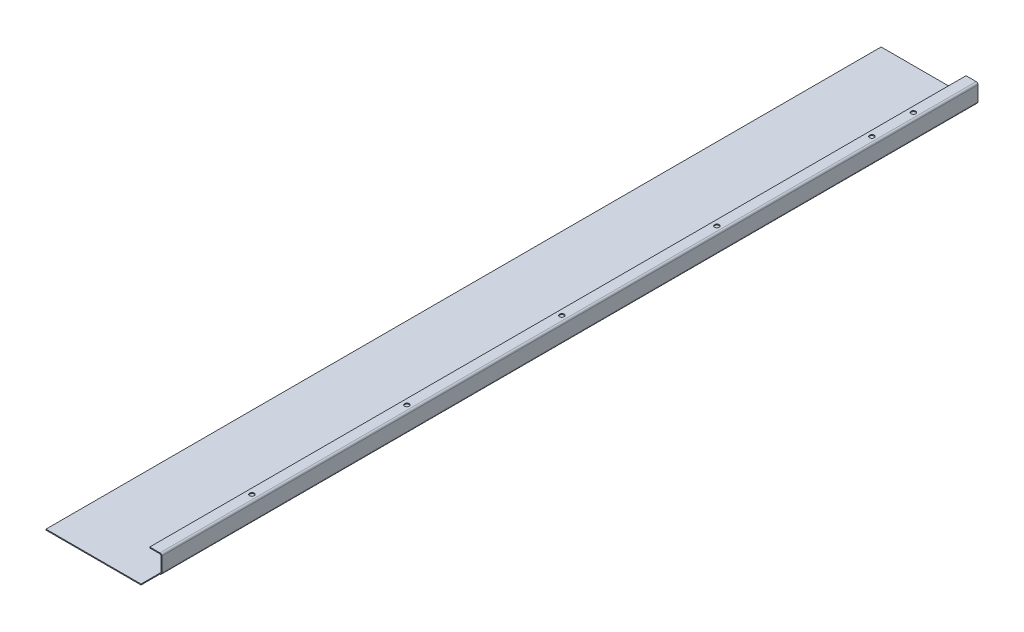
ISO-10303-21;
HEADER;
FILE_DESCRIPTION(('STEP AP214'),'2;1');
FILE_NAME('part.step','',(''),(''),'','','');
FILE_SCHEMA(('AUTOMOTIVE_DESIGN { 1 0 10303 214 1 1 1 1 }'));
ENDSEC;
DATA;
#1=APPLICATION_CONTEXT('core data for automotive mechanical design processes');
#2=APPLICATION_PROTOCOL_DEFINITION('international standard','automotive_design',2000,#1);
#3=PRODUCT_CONTEXT('',#1,'mechanical');
#4=PRODUCT('Part','Part','',(#3));
#5=PRODUCT_RELATED_PRODUCT_CATEGORY('part','',(#4));
#6=PRODUCT_DEFINITION_FORMATION('','',#4);
#7=PRODUCT_DEFINITION_CONTEXT('part definition',#1,'design');
#8=PRODUCT_DEFINITION('design','',#6,#7);
#9=PRODUCT_DEFINITION_SHAPE('','',#8);
#10=(LENGTH_UNIT() NAMED_UNIT(*) SI_UNIT(.MILLI.,.METRE.));
#11=(NAMED_UNIT(*) PLANE_ANGLE_UNIT() SI_UNIT($,.RADIAN.));
#12=(NAMED_UNIT(*) SI_UNIT($,.STERADIAN.) SOLID_ANGLE_UNIT());
#13=UNCERTAINTY_MEASURE_WITH_UNIT(LENGTH_MEASURE(1.E-05),#10,'distance_accuracy_value','');
#14=(GEOMETRIC_REPRESENTATION_CONTEXT(3) GLOBAL_UNCERTAINTY_ASSIGNED_CONTEXT((#13)) GLOBAL_UNIT_ASSIGNED_CONTEXT((#10,
#11,#12)) REPRESENTATION_CONTEXT('',''));
#15=CARTESIAN_POINT('',(0.,0.,0.));
#16=DIRECTION('',(0.,0.,1.));
#17=DIRECTION('',(1.,0.,0.));
#18=AXIS2_PLACEMENT_3D('',#15,#16,#17);
#19=CARTESIAN_POINT('',(105.,-3.86956670765295E-13,0.));
#20=DIRECTION('',(-1.,0.,0.));
#21=DIRECTION('',(0.,-1.,0.));
#22=AXIS2_PLACEMENT_3D('',#19,#20,#21);
#23=PLANE('',#22);
#24=DIRECTION('',(0.,-1.,0.));
#25=VECTOR('',#24,1.);
#26=CARTESIAN_POINT('',(105.,-3.87117238849561E-13,-20.5));
#27=LINE('',#26,#25);
#28=CARTESIAN_POINT('',(105.,17.,-20.5));
#29=VERTEX_POINT('',#28);
#30=CARTESIAN_POINT('',(105.,0.999999999999942,-20.5));
#31=VERTEX_POINT('',#30);
#32=EDGE_CURVE('E369',#29,#31,#27,.T.);
#33=ORIENTED_EDGE('',*,*,#32,.T.);
#34=DIRECTION('',(0.,0.,-1.));
#35=VECTOR('',#34,1.);
#36=CARTESIAN_POINT('',(105.,0.999999999999997,0.));
#37=LINE('',#36,#35);
#38=CARTESIAN_POINT('',(105.,0.999999999999942,-905.2));
#39=VERTEX_POINT('',#38);
#40=EDGE_CURVE('E239',#39,#31,#37,.F.);
#41=ORIENTED_EDGE('',*,*,#40,.F.);
#42=DIRECTION('',(0.,1.,0.));
#43=VECTOR('',#42,1.);
#44=CARTESIAN_POINT('',(105.,-3.86956670765295E-13,-905.2));
#45=LINE('',#44,#43);
#46=CARTESIAN_POINT('',(105.,17.,-905.2));
#47=VERTEX_POINT('',#46);
#48=EDGE_CURVE('E234',#39,#47,#45,.T.);
#49=ORIENTED_EDGE('',*,*,#48,.T.);
#50=DIRECTION('',(0.,0.,-1.));
#51=VECTOR('',#50,1.);
#52=CARTESIAN_POINT('',(105.,17.,-905.2));
#53=LINE('',#52,#51);
#54=EDGE_CURVE('E222',#47,#29,#53,.F.);
#55=ORIENTED_EDGE('',*,*,#54,.T.);
#56=EDGE_LOOP('',(#33,#41,#49,#55));
#57=FACE_BOUND('',#56,.T.);
#58=ADVANCED_FACE('F80',(#57),#23,.F.);
#59=CARTESIAN_POINT('',(104.,-3.83465189426452E-13,0.));
#60=DIRECTION('',(-1.,0.,0.));
#61=DIRECTION('',(0.,-1.,0.));
#62=AXIS2_PLACEMENT_3D('',#59,#60,#61);
#63=PLANE('',#62);
#64=DIRECTION('',(0.,0.,-1.));
#65=VECTOR('',#64,1.);
#66=CARTESIAN_POINT('',(104.,1.,0.));
#67=LINE('',#66,#65);
#68=CARTESIAN_POINT('',(104.,0.999999999999945,-20.5));
#69=VERTEX_POINT('',#68);
#70=CARTESIAN_POINT('',(104.,0.999999999999973,-905.2));
#71=VERTEX_POINT('',#70);
#72=EDGE_CURVE('E233',#69,#71,#67,.T.);
#73=ORIENTED_EDGE('',*,*,#72,.F.);
#74=DIRECTION('',(0.,-1.,0.));
#75=VECTOR('',#74,1.);
#76=CARTESIAN_POINT('',(104.,-3.83465189426452E-13,-20.5));
#77=LINE('',#76,#75);
#78=CARTESIAN_POINT('',(104.,17.,-20.5));
#79=VERTEX_POINT('',#78);
#80=EDGE_CURVE('E370',#79,#69,#77,.T.);
#81=ORIENTED_EDGE('',*,*,#80,.F.);
#82=DIRECTION('',(0.,0.,-1.));
#83=VECTOR('',#82,1.);
#84=CARTESIAN_POINT('',(104.,17.,-905.2));
#85=LINE('',#84,#83);
#86=CARTESIAN_POINT('',(104.,17.,-905.2));
#87=VERTEX_POINT('',#86);
#88=EDGE_CURVE('E105',#87,#79,#85,.F.);
#89=ORIENTED_EDGE('',*,*,#88,.F.);
#90=DIRECTION('',(0.,-1.,0.));
#91=VECTOR('',#90,1.);
#92=CARTESIAN_POINT('',(104.,19.,-905.2));
#93=LINE('',#92,#91);
#94=EDGE_CURVE('E237',#71,#87,#93,.F.);
#95=ORIENTED_EDGE('',*,*,#94,.F.);
#96=EDGE_LOOP('',(#73,#81,#89,#95));
#97=FACE_BOUND('',#96,.T.);
#98=ADVANCED_FACE('F387',(#97),#63,.T.);
#99=CARTESIAN_POINT('',(103.,0.999999999999977,-905.2));
#100=DIRECTION('',(0.,0.,-1.));
#101=DIRECTION('',(1.,0.,0.));
#102=AXIS2_PLACEMENT_3D('',#99,#100,#101);
#103=CYLINDRICAL_SURFACE('',#102,2.00000000000008);
#104=ORIENTED_EDGE('',*,*,#40,.T.);
#105=CARTESIAN_POINT('',(103.,0.999999999999893,-20.5));
#106=DIRECTION('',(0.,0.,-1.));
#107=DIRECTION('',(-1.,0.,0.));
#108=AXIS2_PLACEMENT_3D('',#105,#106,#107);
#109=CIRCLE('',#108,2.);
#110=CARTESIAN_POINT('',(103.,-1.00000000000011,-20.5));
#111=VERTEX_POINT('',#110);
#112=EDGE_CURVE('E339',#31,#111,#109,.T.);
#113=ORIENTED_EDGE('',*,*,#112,.T.);
#114=DIRECTION('',(0.,0.,-1.));
#115=VECTOR('',#114,1.);
#116=CARTESIAN_POINT('',(103.,-1.00000000000011,-905.2));
#117=LINE('',#116,#115);
#118=CARTESIAN_POINT('',(103.,-1.00000000000011,-905.2));
#119=VERTEX_POINT('',#118);
#120=EDGE_CURVE('E246',#119,#111,#117,.F.);
#121=ORIENTED_EDGE('',*,*,#120,.F.);
#122=CARTESIAN_POINT('',(103.,0.999999999999977,-905.2));
#123=DIRECTION('',(0.,0.,-1.));
#124=DIRECTION('',(-1.,0.,0.));
#125=AXIS2_PLACEMENT_3D('',#122,#123,#124);
#126=CIRCLE('',#125,2.00000000000008);
#127=EDGE_CURVE('E250',#39,#119,#126,.T.);
#128=ORIENTED_EDGE('',*,*,#127,.F.);
#129=EDGE_LOOP('',(#104,#113,#121,#128));
#130=FACE_BOUND('',#129,.T.);
#131=ADVANCED_FACE('F393',(#130),#103,.T.);
#132=CARTESIAN_POINT('',(103.,0.999999999999977,-905.2));
#133=DIRECTION('',(0.,0.,-1.));
#134=DIRECTION('',(1.,0.,0.));
#135=AXIS2_PLACEMENT_3D('',#132,#133,#134);
#136=CYLINDRICAL_SURFACE('',#135,1.00000000000008);
#137=CARTESIAN_POINT('',(103.,0.999999999999893,-20.5));
#138=DIRECTION('',(0.,0.,1.));
#139=DIRECTION('',(1.,0.,0.));
#140=AXIS2_PLACEMENT_3D('',#137,#138,#139);
#141=CIRCLE('',#140,1.);
#142=CARTESIAN_POINT('',(103.,-1.07336015076065E-13,-20.5));
#143=VERTEX_POINT('',#142);
#144=EDGE_CURVE('E355',#69,#143,#141,.F.);
#145=ORIENTED_EDGE('',*,*,#144,.F.);
#146=ORIENTED_EDGE('',*,*,#72,.T.);
#147=CARTESIAN_POINT('',(103.,0.999999999999977,-905.2));
#148=DIRECTION('',(0.,0.,-1.));
#149=DIRECTION('',(-1.,0.,0.));
#150=AXIS2_PLACEMENT_3D('',#147,#148,#149);
#151=CIRCLE('',#150,1.00000000000008);
#152=CARTESIAN_POINT('',(103.,-1.07336015076065E-13,-905.2));
#153=VERTEX_POINT('',#152);
#154=EDGE_CURVE('E236',#71,#153,#151,.T.);
#155=ORIENTED_EDGE('',*,*,#154,.T.);
#156=DIRECTION('',(0.,0.,-1.));
#157=VECTOR('',#156,1.);
#158=CARTESIAN_POINT('',(103.,-1.07336015076065E-13,-905.2));
#159=LINE('',#158,#157);
#160=EDGE_CURVE('E253',#153,#143,#159,.F.);
#161=ORIENTED_EDGE('',*,*,#160,.T.);
#162=EDGE_LOOP('',(#145,#146,#155,#161));
#163=FACE_BOUND('',#162,.T.);
#164=ADVANCED_FACE('F400',(#163),#136,.F.);
#165=CARTESIAN_POINT('',(103.,17.,-905.2));
#166=DIRECTION('',(0.,0.,-1.));
#167=DIRECTION('',(0.,1.,0.));
#168=AXIS2_PLACEMENT_3D('',#165,#166,#167);
#169=CYLINDRICAL_SURFACE('',#168,2.);
#170=DIRECTION('',(0.,0.,-1.));
#171=VECTOR('',#170,1.);
#172=CARTESIAN_POINT('',(103.,19.,0.));
#173=LINE('',#172,#171);
#174=CARTESIAN_POINT('',(103.,19.,-905.2));
#175=VERTEX_POINT('',#174);
#176=CARTESIAN_POINT('',(103.,19.,-20.5));
#177=VERTEX_POINT('',#176);
#178=EDGE_CURVE('E202',#175,#177,#173,.F.);
#179=ORIENTED_EDGE('',*,*,#178,.T.);
#180=CARTESIAN_POINT('',(103.,17.,-20.5000000000002));
#181=DIRECTION('',(0.,0.,-1.));
#182=DIRECTION('',(-1.,0.,0.));
#183=AXIS2_PLACEMENT_3D('',#180,#181,#182);
#184=CIRCLE('',#183,2.);
#185=EDGE_CURVE('E186',#177,#29,#184,.T.);
#186=ORIENTED_EDGE('',*,*,#185,.T.);
#187=ORIENTED_EDGE('',*,*,#54,.F.);
#188=CARTESIAN_POINT('',(103.,17.,-905.2));
#189=DIRECTION('',(0.,0.,-1.));
#190=DIRECTION('',(-1.,0.,0.));
#191=AXIS2_PLACEMENT_3D('',#188,#189,#190);
#192=CIRCLE('',#191,2.);
#193=EDGE_CURVE('E210',#175,#47,#192,.T.);
#194=ORIENTED_EDGE('',*,*,#193,.F.);
#195=EDGE_LOOP('',(#179,#186,#187,#194));
#196=FACE_BOUND('',#195,.T.);
#197=ADVANCED_FACE('F208',(#196),#169,.T.);
#198=CARTESIAN_POINT('',(103.,17.,-905.2));
#199=DIRECTION('',(0.,0.,-1.));
#200=DIRECTION('',(0.,1.,0.));
#201=AXIS2_PLACEMENT_3D('',#198,#199,#200);
#202=CYLINDRICAL_SURFACE('',#201,1.);
#203=CARTESIAN_POINT('',(103.,17.,-20.5000000000002));
#204=DIRECTION('',(0.,0.,1.));
#205=DIRECTION('',(1.,0.,0.));
#206=AXIS2_PLACEMENT_3D('',#203,#204,#205);
#207=CIRCLE('',#206,1.);
#208=CARTESIAN_POINT('',(103.,18.,-20.5000000000002));
#209=VERTEX_POINT('',#208);
#210=EDGE_CURVE('E196',#209,#79,#207,.F.);
#211=ORIENTED_EDGE('',*,*,#210,.F.);
#212=DIRECTION('',(0.,0.,-1.));
#213=VECTOR('',#212,1.);
#214=CARTESIAN_POINT('',(103.,18.,0.));
#215=LINE('',#214,#213);
#216=CARTESIAN_POINT('',(103.,18.,-905.2));
#217=VERTEX_POINT('',#216);
#218=EDGE_CURVE('E217',#209,#217,#215,.T.);
#219=ORIENTED_EDGE('',*,*,#218,.T.);
#220=CARTESIAN_POINT('',(103.,17.,-905.2));
#221=DIRECTION('',(0.,0.,-1.));
#222=DIRECTION('',(-1.,0.,0.));
#223=AXIS2_PLACEMENT_3D('',#220,#221,#222);
#224=CIRCLE('',#223,1.);
#225=EDGE_CURVE('E227',#217,#87,#224,.T.);
#226=ORIENTED_EDGE('',*,*,#225,.T.);
#227=ORIENTED_EDGE('',*,*,#88,.T.);
#228=EDGE_LOOP('',(#211,#219,#226,#227));
#229=FACE_BOUND('',#228,.T.);
#230=ADVANCED_FACE('F321',(#229),#202,.F.);
#231=CARTESIAN_POINT('',(1.40823756520346E-13,19.0000000000008,0.));
#232=DIRECTION('',(0.,-1.,0.));
#233=DIRECTION('',(1.,0.,0.));
#234=AXIS2_PLACEMENT_3D('',#231,#232,#233);
#235=PLANE('',#234);
#236=CARTESIAN_POINT('',(98.0000000000165,19.,-125.2));
#237=DIRECTION('',(0.,1.,0.));
#238=DIRECTION('',(-1.,0.,0.));
#239=AXIS2_PLACEMENT_3D('',#236,#237,#238);
#240=CIRCLE('',#239,2.5);
#241=CARTESIAN_POINT('',(95.5000000000165,19.0000000000001,-125.2));
#242=VERTEX_POINT('',#241);
#243=EDGE_CURVE('E335',#242,#242,#240,.T.);
#244=ORIENTED_EDGE('',*,*,#243,.F.);
#245=EDGE_LOOP('',(#244));
#246=FACE_BOUND('',#245,.T.);
#247=CARTESIAN_POINT('',(98.0000000000123,19.,-293.2));
#248=DIRECTION('',(0.,1.,0.));
#249=DIRECTION('',(-1.,0.,0.));
#250=AXIS2_PLACEMENT_3D('',#247,#248,#249);
#251=CIRCLE('',#250,2.50000000000001);
#252=CARTESIAN_POINT('',(95.5000000000123,19.0000000000001,-293.2));
#253=VERTEX_POINT('',#252);
#254=EDGE_CURVE('E338',#253,#253,#251,.T.);
#255=ORIENTED_EDGE('',*,*,#254,.F.);
#256=EDGE_LOOP('',(#255));
#257=FACE_BOUND('',#256,.T.);
#258=CARTESIAN_POINT('',(98.0000000000082,19.,-461.2));
#259=DIRECTION('',(0.,1.,0.));
#260=DIRECTION('',(-1.,0.,0.));
#261=AXIS2_PLACEMENT_3D('',#258,#259,#260);
#262=CIRCLE('',#261,2.50000000000001);
#263=CARTESIAN_POINT('',(95.5000000000082,19.0000000000001,-461.2));
#264=VERTEX_POINT('',#263);
#265=EDGE_CURVE('E342',#264,#264,#262,.T.);
#266=ORIENTED_EDGE('',*,*,#265,.F.);
#267=EDGE_LOOP('',(#266));
#268=FACE_BOUND('',#267,.T.);
#269=CARTESIAN_POINT('',(98.0000000000041,19.,-629.2));
#270=DIRECTION('',(0.,1.,0.));
#271=DIRECTION('',(-1.,0.,0.));
#272=AXIS2_PLACEMENT_3D('',#269,#270,#271);
#273=CIRCLE('',#272,2.5);
#274=CARTESIAN_POINT('',(95.5000000000041,19.0000000000001,-629.2));
#275=VERTEX_POINT('',#274);
#276=EDGE_CURVE('E345',#275,#275,#273,.T.);
#277=ORIENTED_EDGE('',*,*,#276,.F.);
#278=EDGE_LOOP('',(#277));
#279=FACE_BOUND('',#278,.T.);
#280=CARTESIAN_POINT('',(97.9999999999999,19.,-797.2));
#281=DIRECTION('',(0.,1.,0.));
#282=DIRECTION('',(-1.,0.,0.));
#283=AXIS2_PLACEMENT_3D('',#280,#281,#282);
#284=CIRCLE('',#283,2.50000000000001);
#285=CARTESIAN_POINT('',(95.4999999999999,19.0000000000001,-797.2));
#286=VERTEX_POINT('',#285);
#287=EDGE_CURVE('E348',#286,#286,#284,.T.);
#288=ORIENTED_EDGE('',*,*,#287,.F.);
#289=EDGE_LOOP('',(#288));
#290=FACE_BOUND('',#289,.T.);
#291=CARTESIAN_POINT('',(97.9999999999999,19.,-842.2));
#292=DIRECTION('',(0.,1.,0.));
#293=DIRECTION('',(-1.,0.,0.));
#294=AXIS2_PLACEMENT_3D('',#291,#292,#293);
#295=CIRCLE('',#294,2.5);
#296=CARTESIAN_POINT('',(95.4999999999999,19.0000000000001,-842.2));
#297=VERTEX_POINT('',#296);
#298=EDGE_CURVE('E283',#297,#297,#295,.T.);
#299=ORIENTED_EDGE('',*,*,#298,.F.);
#300=EDGE_LOOP('',(#299));
#301=FACE_BOUND('',#300,.T.);
#302=DIRECTION('',(1.,0.,0.));
#303=VECTOR('',#302,1.);
#304=CARTESIAN_POINT('',(1.4090824024163E-13,19.0000000000008,-20.5));
#305=LINE('',#304,#303);
#306=CARTESIAN_POINT('',(92.0000000000001,19.0000000000001,-20.5));
#307=VERTEX_POINT('',#306);
#308=EDGE_CURVE('E97',#307,#177,#305,.T.);
#309=ORIENTED_EDGE('',*,*,#308,.T.);
#310=ORIENTED_EDGE('',*,*,#178,.F.);
#311=DIRECTION('',(-1.,0.,0.));
#312=VECTOR('',#311,1.);
#313=CARTESIAN_POINT('',(1.40823756520346E-13,19.0000000000008,-905.2));
#314=LINE('',#313,#312);
#315=CARTESIAN_POINT('',(91.9999999999999,19.0000000000001,-905.2));
#316=VERTEX_POINT('',#315);
#317=EDGE_CURVE('E329',#175,#316,#314,.T.);
#318=ORIENTED_EDGE('',*,*,#317,.T.);
#319=DIRECTION('',(0.,0.,1.));
#320=VECTOR('',#319,1.);
#321=CARTESIAN_POINT('',(92.0000000000001,19.0000000000001,0.));
#322=LINE('',#321,#320);
#323=EDGE_CURVE('E205',#316,#307,#322,.T.);
#324=ORIENTED_EDGE('',*,*,#323,.T.);
#325=EDGE_LOOP('',(#309,#310,#318,#324));
#326=FACE_BOUND('',#325,.T.);
#327=ADVANCED_FACE('F201',(#246,#257,#268,#279,#290,#301,#326),#235,.F.);
#328=CARTESIAN_POINT('',(1.33680225758394E-13,18.0000000000008,0.));
#329=DIRECTION('',(0.,-1.,0.));
#330=DIRECTION('',(1.,0.,0.));
#331=AXIS2_PLACEMENT_3D('',#328,#329,#330);
#332=PLANE('',#331);
#333=CARTESIAN_POINT('',(97.9999999999999,18.,-842.2));
#334=DIRECTION('',(0.,-1.,0.));
#335=DIRECTION('',(1.,0.,0.));
#336=AXIS2_PLACEMENT_3D('',#333,#334,#335);
#337=CIRCLE('',#336,2.5);
#338=CARTESIAN_POINT('',(100.5,18.,-842.2));
#339=VERTEX_POINT('',#338);
#340=EDGE_CURVE('E84',#339,#339,#337,.T.);
#341=ORIENTED_EDGE('',*,*,#340,.F.);
#342=EDGE_LOOP('',(#341));
#343=FACE_BOUND('',#342,.T.);
#344=CARTESIAN_POINT('',(97.9999999999999,18.,-797.2));
#345=DIRECTION('',(0.,-1.,0.));
#346=DIRECTION('',(1.,0.,0.));
#347=AXIS2_PLACEMENT_3D('',#344,#345,#346);
#348=CIRCLE('',#347,2.50000000000001);
#349=CARTESIAN_POINT('',(100.5,18.,-797.2));
#350=VERTEX_POINT('',#349);
#351=EDGE_CURVE('E291',#350,#350,#348,.T.);
#352=ORIENTED_EDGE('',*,*,#351,.F.);
#353=EDGE_LOOP('',(#352));
#354=FACE_BOUND('',#353,.T.);
#355=CARTESIAN_POINT('',(98.0000000000041,18.,-629.2));
#356=DIRECTION('',(0.,-1.,0.));
#357=DIRECTION('',(1.,0.,0.));
#358=AXIS2_PLACEMENT_3D('',#355,#356,#357);
#359=CIRCLE('',#358,2.5);
#360=CARTESIAN_POINT('',(100.500000000004,18.,-629.2));
#361=VERTEX_POINT('',#360);
#362=EDGE_CURVE('E289',#361,#361,#359,.T.);
#363=ORIENTED_EDGE('',*,*,#362,.F.);
#364=EDGE_LOOP('',(#363));
#365=FACE_BOUND('',#364,.T.);
#366=CARTESIAN_POINT('',(98.0000000000082,18.,-461.2));
#367=DIRECTION('',(0.,-1.,0.));
#368=DIRECTION('',(1.,0.,0.));
#369=AXIS2_PLACEMENT_3D('',#366,#367,#368);
#370=CIRCLE('',#369,2.50000000000001);
#371=CARTESIAN_POINT('',(100.500000000008,18.,-461.2));
#372=VERTEX_POINT('',#371);
#373=EDGE_CURVE('E286',#372,#372,#370,.T.);
#374=ORIENTED_EDGE('',*,*,#373,.F.);
#375=EDGE_LOOP('',(#374));
#376=FACE_BOUND('',#375,.T.);
#377=CARTESIAN_POINT('',(98.0000000000123,18.,-293.2));
#378=DIRECTION('',(0.,-1.,0.));
#379=DIRECTION('',(1.,0.,0.));
#380=AXIS2_PLACEMENT_3D('',#377,#378,#379);
#381=CIRCLE('',#380,2.50000000000001);
#382=CARTESIAN_POINT('',(100.500000000012,18.,-293.2));
#383=VERTEX_POINT('',#382);
#384=EDGE_CURVE('E282',#383,#383,#381,.T.);
#385=ORIENTED_EDGE('',*,*,#384,.F.);
#386=EDGE_LOOP('',(#385));
#387=FACE_BOUND('',#386,.T.);
#388=CARTESIAN_POINT('',(98.0000000000165,18.,-125.2));
#389=DIRECTION('',(0.,-1.,0.));
#390=DIRECTION('',(1.,0.,0.));
#391=AXIS2_PLACEMENT_3D('',#388,#389,#390);
#392=CIRCLE('',#391,2.5);
#393=CARTESIAN_POINT('',(100.500000000016,18.,-125.2));
#394=VERTEX_POINT('',#393);
#395=EDGE_CURVE('E279',#394,#394,#392,.T.);
#396=ORIENTED_EDGE('',*,*,#395,.F.);
#397=EDGE_LOOP('',(#396));
#398=FACE_BOUND('',#397,.T.);
#399=ORIENTED_EDGE('',*,*,#218,.F.);
#400=DIRECTION('',(1.,0.,0.));
#401=VECTOR('',#400,1.);
#402=CARTESIAN_POINT('',(1.30156829789573E-13,18.0000000000008,-20.5));
#403=LINE('',#402,#401);
#404=CARTESIAN_POINT('',(92.0000000000001,18.0000000000001,-20.5));
#405=VERTEX_POINT('',#404);
#406=EDGE_CURVE('E181',#405,#209,#403,.T.);
#407=ORIENTED_EDGE('',*,*,#406,.F.);
#408=DIRECTION('',(0.,0.,-1.));
#409=VECTOR('',#408,1.);
#410=CARTESIAN_POINT('',(92.0000000000001,18.0000000000001,0.));
#411=LINE('',#410,#409);
#412=CARTESIAN_POINT('',(91.9999999999999,18.0000000000001,-905.2));
#413=VERTEX_POINT('',#412);
#414=EDGE_CURVE('E215',#413,#405,#411,.F.);
#415=ORIENTED_EDGE('',*,*,#414,.F.);
#416=DIRECTION('',(1.,0.,0.));
#417=VECTOR('',#416,1.);
#418=CARTESIAN_POINT('',(91.9999999999999,18.0000000000001,-905.2));
#419=LINE('',#418,#417);
#420=EDGE_CURVE('E212',#217,#413,#419,.F.);
#421=ORIENTED_EDGE('',*,*,#420,.F.);
#422=EDGE_LOOP('',(#399,#407,#415,#421));
#423=FACE_BOUND('',#422,.T.);
#424=ADVANCED_FACE('F301',(#343,#354,#365,#376,#387,#398,#423),#332,.T.);
#425=CARTESIAN_POINT('',(92.0000000000001,19.0000000000001,0.));
#426=DIRECTION('',(1.,0.,0.));
#427=DIRECTION('',(0.,1.,0.));
#428=AXIS2_PLACEMENT_3D('',#425,#426,#427);
#429=PLANE('',#428);
#430=DIRECTION('',(0.,-1.,0.));
#431=VECTOR('',#430,1.);
#432=CARTESIAN_POINT('',(92.0000000000001,18.0000000000001,-20.5));
#433=LINE('',#432,#431);
#434=EDGE_CURVE('E206',#405,#307,#433,.F.);
#435=ORIENTED_EDGE('',*,*,#434,.T.);
#436=ORIENTED_EDGE('',*,*,#323,.F.);
#437=DIRECTION('',(0.,-1.,0.));
#438=VECTOR('',#437,1.);
#439=CARTESIAN_POINT('',(91.9999999999999,19.0000000000001,-905.2));
#440=LINE('',#439,#438);
#441=EDGE_CURVE('E230',#316,#413,#440,.T.);
#442=ORIENTED_EDGE('',*,*,#441,.T.);
#443=ORIENTED_EDGE('',*,*,#414,.T.);
#444=EDGE_LOOP('',(#435,#436,#442,#443));
#445=FACE_BOUND('',#444,.T.);
#446=ADVANCED_FACE('F304',(#445),#429,.F.);
#447=CARTESIAN_POINT('',(105.,19.,-905.2));
#448=DIRECTION('',(0.,0.,1.));
#449=DIRECTION('',(1.,0.,0.));
#450=AXIS2_PLACEMENT_3D('',#447,#448,#449);
#451=PLANE('',#450);
#452=DIRECTION('',(1.,0.,0.));
#453=VECTOR('',#452,1.);
#454=CARTESIAN_POINT('',(104.,17.,-905.2));
#455=LINE('',#454,#453);
#456=EDGE_CURVE('E224',#87,#47,#455,.T.);
#457=ORIENTED_EDGE('',*,*,#456,.T.);
#458=ORIENTED_EDGE('',*,*,#48,.F.);
#459=DIRECTION('',(-1.,0.,0.));
#460=VECTOR('',#459,1.);
#461=CARTESIAN_POINT('',(104.,0.999999999999945,-905.2));
#462=LINE('',#461,#460);
#463=EDGE_CURVE('E242',#71,#39,#462,.F.);
#464=ORIENTED_EDGE('',*,*,#463,.F.);
#465=ORIENTED_EDGE('',*,*,#94,.T.);
#466=EDGE_LOOP('',(#457,#458,#464,#465));
#467=FACE_BOUND('',#466,.T.);
#468=ADVANCED_FACE('F377',(#467),#451,.F.);
#469=CARTESIAN_POINT('',(-1.66533453693773E-13,-1.,-905.2));
#470=DIRECTION('',(0.,0.,-1.));
#471=DIRECTION('',(-1.,0.,0.));
#472=AXIS2_PLACEMENT_3D('',#469,#470,#471);
#473=PLANE('',#472);
#474=DIRECTION('',(-1.,0.,0.));
#475=VECTOR('',#474,1.);
#476=CARTESIAN_POINT('',(-1.66533453693773E-13,0.,-905.2));
#477=LINE('',#476,#475);
#478=CARTESIAN_POINT('',(-1.66533453693773E-13,0.,-905.2));
#479=VERTEX_POINT('',#478);
#480=EDGE_CURVE('E267',#153,#479,#477,.T.);
#481=ORIENTED_EDGE('',*,*,#480,.F.);
#482=DIRECTION('',(0.,-1.,0.));
#483=VECTOR('',#482,1.);
#484=CARTESIAN_POINT('',(103.,-1.07336015076065E-13,-905.2));
#485=LINE('',#484,#483);
#486=EDGE_CURVE('E249',#153,#119,#485,.T.);
#487=ORIENTED_EDGE('',*,*,#486,.T.);
#488=DIRECTION('',(-1.,0.,0.));
#489=VECTOR('',#488,1.);
#490=CARTESIAN_POINT('',(-1.66533453693773E-13,-1.,-905.2));
#491=LINE('',#490,#489);
#492=CARTESIAN_POINT('',(-1.66533453693773E-13,-1.,-905.2));
#493=VERTEX_POINT('',#492);
#494=EDGE_CURVE('E270',#119,#493,#491,.T.);
#495=ORIENTED_EDGE('',*,*,#494,.T.);
#496=DIRECTION('',(0.,1.,0.));
#497=VECTOR('',#496,1.);
#498=CARTESIAN_POINT('',(-1.66533453693773E-13,-1.,-905.2));
#499=LINE('',#498,#497);
#500=EDGE_CURVE('E13',#493,#479,#499,.T.);
#501=ORIENTED_EDGE('',*,*,#500,.T.);
#502=EDGE_LOOP('',(#481,#487,#495,#501));
#503=FACE_BOUND('',#502,.T.);
#504=ADVANCED_FACE('F382',(#503),#473,.T.);
#505=CARTESIAN_POINT('',(0.,-1.,0.));
#506=DIRECTION('',(0.,-1.,0.));
#507=DIRECTION('',(0.,0.,-1.));
#508=AXIS2_PLACEMENT_3D('',#505,#506,#507);
#509=PLANE('',#508);
#510=ORIENTED_EDGE('',*,*,#494,.F.);
#511=ORIENTED_EDGE('',*,*,#120,.T.);
#512=DIRECTION('',(0.,0.,-1.));
#513=VECTOR('',#512,1.);
#514=CARTESIAN_POINT('',(103.,-1.00000000000011,-905.2));
#515=LINE('',#514,#513);
#516=CARTESIAN_POINT('',(103.,-1.00000000000011,0.));
#517=VERTEX_POINT('',#516);
#518=EDGE_CURVE('E360',#111,#517,#515,.F.);
#519=ORIENTED_EDGE('',*,*,#518,.T.);
#520=DIRECTION('',(1.,0.,0.));
#521=VECTOR('',#520,1.);
#522=CARTESIAN_POINT('',(0.,-1.,0.));
#523=LINE('',#522,#521);
#524=CARTESIAN_POINT('',(0.,-1.,0.));
#525=VERTEX_POINT('',#524);
#526=EDGE_CURVE('E266',#525,#517,#523,.T.);
#527=ORIENTED_EDGE('',*,*,#526,.F.);
#528=DIRECTION('',(0.,0.,1.));
#529=VECTOR('',#528,1.);
#530=CARTESIAN_POINT('',(0.,-1.,0.));
#531=LINE('',#530,#529);
#532=EDGE_CURVE('E263',#493,#525,#531,.T.);
#533=ORIENTED_EDGE('',*,*,#532,.F.);
#534=EDGE_LOOP('',(#510,#511,#519,#527,#533));
#535=FACE_BOUND('',#534,.T.);
#536=ADVANCED_FACE('F410',(#535),#509,.T.);
#537=CARTESIAN_POINT('',(0.,0.,0.));
#538=DIRECTION('',(0.,-1.,0.));
#539=DIRECTION('',(0.,0.,-1.));
#540=AXIS2_PLACEMENT_3D('',#537,#538,#539);
#541=PLANE('',#540);
#542=ORIENTED_EDGE('',*,*,#160,.F.);
#543=ORIENTED_EDGE('',*,*,#480,.T.);
#544=DIRECTION('',(0.,0.,1.));
#545=VECTOR('',#544,1.);
#546=CARTESIAN_POINT('',(0.,0.,0.));
#547=LINE('',#546,#545);
#548=CARTESIAN_POINT('',(0.,0.,0.));
#549=VERTEX_POINT('',#548);
#550=EDGE_CURVE('E260',#479,#549,#547,.T.);
#551=ORIENTED_EDGE('',*,*,#550,.T.);
#552=DIRECTION('',(1.,0.,0.));
#553=VECTOR('',#552,1.);
#554=CARTESIAN_POINT('',(0.,0.,0.));
#555=LINE('',#554,#553);
#556=CARTESIAN_POINT('',(103.,-1.07336015076065E-13,0.));
#557=VERTEX_POINT('',#556);
#558=EDGE_CURVE('E274',#549,#557,#555,.T.);
#559=ORIENTED_EDGE('',*,*,#558,.T.);
#560=DIRECTION('',(0.,0.,-1.));
#561=VECTOR('',#560,1.);
#562=CARTESIAN_POINT('',(103.,-1.07336015076065E-13,-905.2));
#563=LINE('',#562,#561);
#564=EDGE_CURVE('E363',#143,#557,#563,.F.);
#565=ORIENTED_EDGE('',*,*,#564,.F.);
#566=EDGE_LOOP('',(#542,#543,#551,#559,#565));
#567=FACE_BOUND('',#566,.T.);
#568=ADVANCED_FACE('F413',(#567),#541,.F.);
#569=CARTESIAN_POINT('',(0.,-1.,0.));
#570=DIRECTION('',(-1.,0.,0.));
#571=DIRECTION('',(0.,0.,1.));
#572=AXIS2_PLACEMENT_3D('',#569,#570,#571);
#573=PLANE('',#572);
#574=ORIENTED_EDGE('',*,*,#550,.F.);
#575=ORIENTED_EDGE('',*,*,#500,.F.);
#576=ORIENTED_EDGE('',*,*,#532,.T.);
#577=DIRECTION('',(0.,1.,0.));
#578=VECTOR('',#577,1.);
#579=CARTESIAN_POINT('',(0.,-1.,0.));
#580=LINE('',#579,#578);
#581=EDGE_CURVE('E89',#525,#549,#580,.T.);
#582=ORIENTED_EDGE('',*,*,#581,.T.);
#583=EDGE_LOOP('',(#574,#575,#576,#582));
#584=FACE_BOUND('',#583,.T.);
#585=ADVANCED_FACE('F82',(#584),#573,.T.);
#586=CARTESIAN_POINT('',(0.,-1.,0.));
#587=DIRECTION('',(0.,0.,1.));
#588=DIRECTION('',(1.,0.,0.));
#589=AXIS2_PLACEMENT_3D('',#586,#587,#588);
#590=PLANE('',#589);
#591=DIRECTION('',(0.,-1.,0.));
#592=VECTOR('',#591,1.);
#593=CARTESIAN_POINT('',(103.,-1.07336015076065E-13,0.));
#594=LINE('',#593,#592);
#595=EDGE_CURVE('E258',#557,#517,#594,.T.);
#596=ORIENTED_EDGE('',*,*,#595,.F.);
#597=ORIENTED_EDGE('',*,*,#558,.F.);
#598=ORIENTED_EDGE('',*,*,#581,.F.);
#599=ORIENTED_EDGE('',*,*,#526,.T.);
#600=EDGE_LOOP('',(#596,#597,#598,#599));
#601=FACE_BOUND('',#600,.T.);
#602=ADVANCED_FACE('F408',(#601),#590,.T.);
#603=CARTESIAN_POINT('',(103.,0.999999999999977,-905.2));
#604=DIRECTION('',(0.,0.,1.));
#605=DIRECTION('',(1.,0.,0.));
#606=AXIS2_PLACEMENT_3D('',#603,#604,#605);
#607=PLANE('',#606);
#608=ORIENTED_EDGE('',*,*,#154,.F.);
#609=ORIENTED_EDGE('',*,*,#463,.T.);
#610=ORIENTED_EDGE('',*,*,#127,.T.);
#611=ORIENTED_EDGE('',*,*,#486,.F.);
#612=EDGE_LOOP('',(#608,#609,#610,#611));
#613=FACE_BOUND('',#612,.T.);
#614=ADVANCED_FACE('F405',(#613),#607,.F.);
#615=CARTESIAN_POINT('',(103.,17.,-905.2));
#616=DIRECTION('',(0.,0.,1.));
#617=DIRECTION('',(1.,0.,0.));
#618=AXIS2_PLACEMENT_3D('',#615,#616,#617);
#619=PLANE('',#618);
#620=ORIENTED_EDGE('',*,*,#225,.F.);
#621=DIRECTION('',(0.,-1.,0.));
#622=VECTOR('',#621,1.);
#623=CARTESIAN_POINT('',(103.,18.,-905.2));
#624=LINE('',#623,#622);
#625=EDGE_CURVE('E213',#217,#175,#624,.F.);
#626=ORIENTED_EDGE('',*,*,#625,.T.);
#627=ORIENTED_EDGE('',*,*,#193,.T.);
#628=ORIENTED_EDGE('',*,*,#456,.F.);
#629=EDGE_LOOP('',(#620,#626,#627,#628));
#630=FACE_BOUND('',#629,.T.);
#631=ADVANCED_FACE('F325',(#630),#619,.F.);
#632=CARTESIAN_POINT('',(91.9999999999999,19.0000000000001,-905.2));
#633=DIRECTION('',(0.,0.,1.));
#634=DIRECTION('',(0.,-1.,0.));
#635=AXIS2_PLACEMENT_3D('',#632,#633,#634);
#636=PLANE('',#635);
#637=ORIENTED_EDGE('',*,*,#625,.F.);
#638=ORIENTED_EDGE('',*,*,#420,.T.);
#639=ORIENTED_EDGE('',*,*,#441,.F.);
#640=ORIENTED_EDGE('',*,*,#317,.F.);
#641=EDGE_LOOP('',(#637,#638,#639,#640));
#642=FACE_BOUND('',#641,.T.);
#643=ADVANCED_FACE('F327',(#642),#636,.F.);
#644=CARTESIAN_POINT('',(98.0000000000164,9.00000000000004,-125.2));
#645=DIRECTION('',(0.,1.,0.));
#646=DIRECTION('',(-1.,0.,0.));
#647=AXIS2_PLACEMENT_3D('',#644,#645,#646);
#648=CYLINDRICAL_SURFACE('',#647,2.5);
#649=ORIENTED_EDGE('',*,*,#395,.T.);
#650=EDGE_LOOP('',(#649));
#651=FACE_BOUND('',#650,.T.);
#652=ORIENTED_EDGE('',*,*,#243,.T.);
#653=EDGE_LOOP('',(#652));
#654=FACE_BOUND('',#653,.T.);
#655=ADVANCED_FACE('F474',(#651,#654),#648,.F.);
#656=CARTESIAN_POINT('',(98.0000000000123,9.00000000000004,-293.2));
#657=DIRECTION('',(0.,1.,0.));
#658=DIRECTION('',(-1.,0.,0.));
#659=AXIS2_PLACEMENT_3D('',#656,#657,#658);
#660=CYLINDRICAL_SURFACE('',#659,2.50000000000001);
#661=ORIENTED_EDGE('',*,*,#384,.T.);
#662=EDGE_LOOP('',(#661));
#663=FACE_BOUND('',#662,.T.);
#664=ORIENTED_EDGE('',*,*,#254,.T.);
#665=EDGE_LOOP('',(#664));
#666=FACE_BOUND('',#665,.T.);
#667=ADVANCED_FACE('F470',(#663,#666),#660,.F.);
#668=CARTESIAN_POINT('',(98.0000000000081,9.00000000000004,-461.2));
#669=DIRECTION('',(0.,1.,0.));
#670=DIRECTION('',(-1.,0.,0.));
#671=AXIS2_PLACEMENT_3D('',#668,#669,#670);
#672=CYLINDRICAL_SURFACE('',#671,2.50000000000001);
#673=ORIENTED_EDGE('',*,*,#373,.T.);
#674=EDGE_LOOP('',(#673));
#675=FACE_BOUND('',#674,.T.);
#676=ORIENTED_EDGE('',*,*,#265,.T.);
#677=EDGE_LOOP('',(#676));
#678=FACE_BOUND('',#677,.T.);
#679=ADVANCED_FACE('F466',(#675,#678),#672,.F.);
#680=CARTESIAN_POINT('',(98.000000000004,9.00000000000004,-629.2));
#681=DIRECTION('',(0.,1.,0.));
#682=DIRECTION('',(-1.,0.,0.));
#683=AXIS2_PLACEMENT_3D('',#680,#681,#682);
#684=CYLINDRICAL_SURFACE('',#683,2.5);
#685=ORIENTED_EDGE('',*,*,#362,.T.);
#686=EDGE_LOOP('',(#685));
#687=FACE_BOUND('',#686,.T.);
#688=ORIENTED_EDGE('',*,*,#276,.T.);
#689=EDGE_LOOP('',(#688));
#690=FACE_BOUND('',#689,.T.);
#691=ADVANCED_FACE('F463',(#687,#690),#684,.F.);
#692=CARTESIAN_POINT('',(97.9999999999998,9.00000000000004,-797.2));
#693=DIRECTION('',(0.,1.,0.));
#694=DIRECTION('',(-1.,0.,0.));
#695=AXIS2_PLACEMENT_3D('',#692,#693,#694);
#696=CYLINDRICAL_SURFACE('',#695,2.50000000000001);
#697=ORIENTED_EDGE('',*,*,#351,.T.);
#698=EDGE_LOOP('',(#697));
#699=FACE_BOUND('',#698,.T.);
#700=ORIENTED_EDGE('',*,*,#287,.T.);
#701=EDGE_LOOP('',(#700));
#702=FACE_BOUND('',#701,.T.);
#703=ADVANCED_FACE('F457',(#699,#702),#696,.F.);
#704=CARTESIAN_POINT('',(97.9999999999999,9.00000000000004,-842.2));
#705=DIRECTION('',(0.,1.,0.));
#706=DIRECTION('',(-1.,0.,0.));
#707=AXIS2_PLACEMENT_3D('',#704,#705,#706);
#708=CYLINDRICAL_SURFACE('',#707,2.5);
#709=ORIENTED_EDGE('',*,*,#340,.T.);
#710=EDGE_LOOP('',(#709));
#711=FACE_BOUND('',#710,.T.);
#712=ORIENTED_EDGE('',*,*,#298,.T.);
#713=EDGE_LOOP('',(#712));
#714=FACE_BOUND('',#713,.T.);
#715=ADVANCED_FACE('F298',(#711,#714),#708,.F.);
#716=CARTESIAN_POINT('',(103.,0.999999999999893,-20.5));
#717=DIRECTION('',(0.,0.,1.));
#718=DIRECTION('',(1.,0.,0.));
#719=AXIS2_PLACEMENT_3D('',#716,#717,#718);
#720=PLANE('',#719);
#721=DIRECTION('',(-1.,0.,0.));
#722=VECTOR('',#721,1.);
#723=CARTESIAN_POINT('',(105.,0.999999999999709,-20.5));
#724=LINE('',#723,#722);
#725=EDGE_CURVE('E185',#31,#69,#724,.T.);
#726=ORIENTED_EDGE('',*,*,#725,.T.);
#727=ORIENTED_EDGE('',*,*,#144,.T.);
#728=DIRECTION('',(0.,-1.,0.));
#729=VECTOR('',#728,1.);
#730=CARTESIAN_POINT('',(103.,-3.76161090580234E-13,-20.5));
#731=LINE('',#730,#729);
#732=EDGE_CURVE('E358',#143,#111,#731,.T.);
#733=ORIENTED_EDGE('',*,*,#732,.T.);
#734=ORIENTED_EDGE('',*,*,#112,.F.);
#735=EDGE_LOOP('',(#726,#727,#733,#734));
#736=FACE_BOUND('',#735,.T.);
#737=ADVANCED_FACE('F449',(#736),#720,.T.);
#738=CARTESIAN_POINT('',(103.,-1.07336015076065E-13,-10.25));
#739=DIRECTION('',(-1.,0.,0.));
#740=DIRECTION('',(0.,0.,-1.));
#741=AXIS2_PLACEMENT_3D('',#738,#739,#740);
#742=PLANE('',#741);
#743=ORIENTED_EDGE('',*,*,#564,.T.);
#744=ORIENTED_EDGE('',*,*,#595,.T.);
#745=ORIENTED_EDGE('',*,*,#518,.F.);
#746=ORIENTED_EDGE('',*,*,#732,.F.);
#747=EDGE_LOOP('',(#743,#744,#745,#746));
#748=FACE_BOUND('',#747,.T.);
#749=ADVANCED_FACE('F431',(#748),#742,.F.);
#750=CARTESIAN_POINT('',(103.,17.,-20.5000000000002));
#751=DIRECTION('',(0.,0.,1.));
#752=DIRECTION('',(1.,0.,0.));
#753=AXIS2_PLACEMENT_3D('',#750,#751,#752);
#754=PLANE('',#753);
#755=ORIENTED_EDGE('',*,*,#210,.T.);
#756=DIRECTION('',(1.,0.,0.));
#757=VECTOR('',#756,1.);
#758=CARTESIAN_POINT('',(104.,17.,-20.5));
#759=LINE('',#758,#757);
#760=EDGE_CURVE('E191',#79,#29,#759,.T.);
#761=ORIENTED_EDGE('',*,*,#760,.T.);
#762=ORIENTED_EDGE('',*,*,#185,.F.);
#763=DIRECTION('',(1.11022302462516E-13,1.,0.));
#764=VECTOR('',#763,1.);
#765=CARTESIAN_POINT('',(103.,17.9999999999998,-20.5));
#766=LINE('',#765,#764);
#767=EDGE_CURVE('E177',#209,#177,#766,.T.);
#768=ORIENTED_EDGE('',*,*,#767,.F.);
#769=EDGE_LOOP('',(#755,#761,#762,#768));
#770=FACE_BOUND('',#769,.T.);
#771=ADVANCED_FACE('F190',(#770),#754,.T.);
#772=CARTESIAN_POINT('',(104.,-3.83465189426452E-13,-20.5));
#773=DIRECTION('',(0.,0.,-1.));
#774=DIRECTION('',(0.,-1.,0.));
#775=AXIS2_PLACEMENT_3D('',#772,#773,#774);
#776=PLANE('',#775);
#777=ORIENTED_EDGE('',*,*,#80,.T.);
#778=ORIENTED_EDGE('',*,*,#725,.F.);
#779=ORIENTED_EDGE('',*,*,#32,.F.);
#780=ORIENTED_EDGE('',*,*,#760,.F.);
#781=EDGE_LOOP('',(#777,#778,#779,#780));
#782=FACE_BOUND('',#781,.T.);
#783=ADVANCED_FACE('F447',(#782),#776,.F.);
#784=CARTESIAN_POINT('',(1.30156829789573E-13,18.0000000000008,-20.5));
#785=DIRECTION('',(0.,0.,-1.));
#786=DIRECTION('',(1.,0.,0.));
#787=AXIS2_PLACEMENT_3D('',#784,#785,#786);
#788=PLANE('',#787);
#789=ORIENTED_EDGE('',*,*,#406,.T.);
#790=ORIENTED_EDGE('',*,*,#767,.T.);
#791=ORIENTED_EDGE('',*,*,#308,.F.);
#792=ORIENTED_EDGE('',*,*,#434,.F.);
#793=EDGE_LOOP('',(#789,#790,#791,#792));
#794=FACE_BOUND('',#793,.T.);
#795=ADVANCED_FACE('F179',(#794),#788,.F.);
#796=CLOSED_SHELL('',(#58,#98,#131,#164,#197,#230,#327,#424,#446,#468,#504,#536,#568,#585,#602,
#614,#631,#643,#655,#667,#679,#691,#703,#715,#737,#749,#771,#783,#795));
#797=MANIFOLD_SOLID_BREP('B2',#796);
#798=ADVANCED_BREP_SHAPE_REPRESENTATION('',(#18,#797),#14);
#799=SHAPE_DEFINITION_REPRESENTATION(#9,#798);
ENDSEC;
END-ISO-10303-21;
